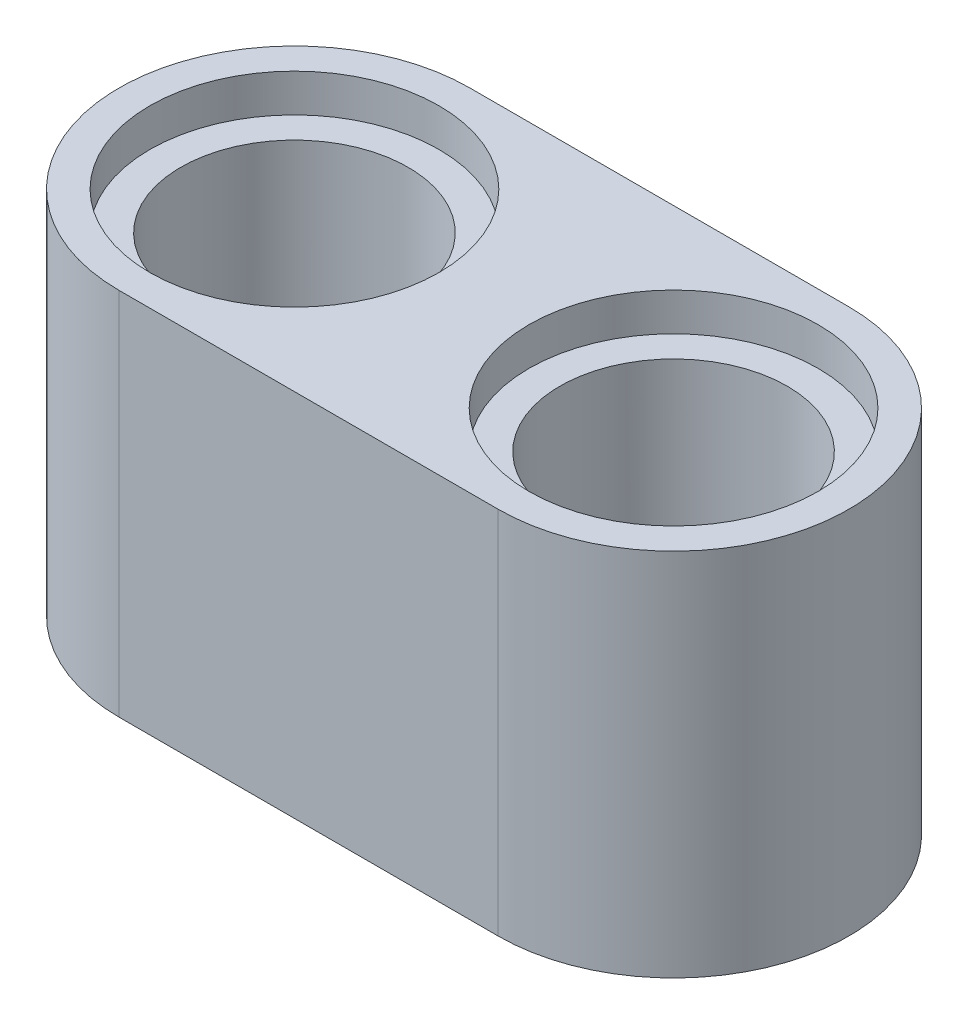
ISO-10303-21;
HEADER;
FILE_DESCRIPTION(('STEP AP214'),'2;1');
FILE_NAME('part.step','',(''),(''),'','','');
FILE_SCHEMA(('AUTOMOTIVE_DESIGN { 1 0 10303 214 1 1 1 1 }'));
ENDSEC;
DATA;
#1=APPLICATION_CONTEXT('core data for automotive mechanical design processes');
#2=APPLICATION_PROTOCOL_DEFINITION('international standard','automotive_design',2000,#1);
#3=PRODUCT_CONTEXT('',#1,'mechanical');
#4=PRODUCT('Part','Part','',(#3));
#5=PRODUCT_RELATED_PRODUCT_CATEGORY('part','',(#4));
#6=PRODUCT_DEFINITION_FORMATION('','',#4);
#7=PRODUCT_DEFINITION_CONTEXT('part definition',#1,'design');
#8=PRODUCT_DEFINITION('design','',#6,#7);
#9=PRODUCT_DEFINITION_SHAPE('','',#8);
#10=(LENGTH_UNIT() NAMED_UNIT(*) SI_UNIT(.MILLI.,.METRE.));
#11=(NAMED_UNIT(*) PLANE_ANGLE_UNIT() SI_UNIT($,.RADIAN.));
#12=(NAMED_UNIT(*) SI_UNIT($,.STERADIAN.) SOLID_ANGLE_UNIT());
#13=UNCERTAINTY_MEASURE_WITH_UNIT(LENGTH_MEASURE(1.E-05),#10,'distance_accuracy_value','');
#14=(GEOMETRIC_REPRESENTATION_CONTEXT(3) GLOBAL_UNCERTAINTY_ASSIGNED_CONTEXT((#13)) GLOBAL_UNIT_ASSIGNED_CONTEXT((#10,
#11,#12)) REPRESENTATION_CONTEXT('',''));
#15=CARTESIAN_POINT('',(0.,0.,0.));
#16=DIRECTION('',(0.,0.,1.));
#17=DIRECTION('',(1.,0.,0.));
#18=AXIS2_PLACEMENT_3D('',#15,#16,#17);
#19=CARTESIAN_POINT('',(-16.,0.,0.));
#20=DIRECTION('',(0.,1.,0.));
#21=DIRECTION('',(0.,0.,1.));
#22=AXIS2_PLACEMENT_3D('',#19,#20,#21);
#23=CYLINDRICAL_SURFACE('',#22,2.4);
#24=CARTESIAN_POINT('',(-16.,7.,0.));
#25=DIRECTION('',(0.,1.,0.));
#26=DIRECTION('',(0.,0.,1.));
#27=AXIS2_PLACEMENT_3D('',#24,#25,#26);
#28=CIRCLE('',#27,2.4);
#29=CARTESIAN_POINT('',(-16.,7.,2.4));
#30=VERTEX_POINT('',#29);
#31=EDGE_CURVE('E115',#30,#30,#28,.F.);
#32=ORIENTED_EDGE('',*,*,#31,.F.);
#33=EDGE_LOOP('',(#32));
#34=FACE_BOUND('',#33,.T.);
#35=CARTESIAN_POINT('',(-16.,0.8,0.));
#36=DIRECTION('',(0.,-1.,0.));
#37=DIRECTION('',(0.,0.,-1.));
#38=AXIS2_PLACEMENT_3D('',#35,#36,#37);
#39=CIRCLE('',#38,2.4);
#40=CARTESIAN_POINT('',(-16.,0.8,-2.4));
#41=VERTEX_POINT('',#40);
#42=EDGE_CURVE('E40',#41,#41,#39,.F.);
#43=ORIENTED_EDGE('',*,*,#42,.F.);
#44=EDGE_LOOP('',(#43));
#45=FACE_BOUND('',#44,.T.);
#46=ADVANCED_FACE('F36',(#34,#45),#23,.F.);
#47=CARTESIAN_POINT('',(-8.,7.8,0.));
#48=DIRECTION('',(0.,-1.,0.));
#49=DIRECTION('',(0.,0.,-1.));
#50=AXIS2_PLACEMENT_3D('',#47,#48,#49);
#51=PLANE('',#50);
#52=CARTESIAN_POINT('',(-16.,7.8,0.));
#53=DIRECTION('',(0.,1.,0.));
#54=DIRECTION('',(0.,0.,1.));
#55=AXIS2_PLACEMENT_3D('',#52,#53,#54);
#56=CIRCLE('',#55,3.05);
#57=CARTESIAN_POINT('',(-16.,7.8,3.05));
#58=VERTEX_POINT('',#57);
#59=EDGE_CURVE('E143',#58,#58,#56,.T.);
#60=ORIENTED_EDGE('',*,*,#59,.F.);
#61=EDGE_LOOP('',(#60));
#62=FACE_BOUND('',#61,.T.);
#63=CARTESIAN_POINT('',(-8.,7.8,0.));
#64=DIRECTION('',(0.,1.,0.));
#65=DIRECTION('',(0.,0.,-1.));
#66=AXIS2_PLACEMENT_3D('',#63,#64,#65);
#67=CIRCLE('',#66,3.05);
#68=CARTESIAN_POINT('',(-8.,7.8,-3.05));
#69=VERTEX_POINT('',#68);
#70=EDGE_CURVE('E126',#69,#69,#67,.T.);
#71=ORIENTED_EDGE('',*,*,#70,.F.);
#72=EDGE_LOOP('',(#71));
#73=FACE_BOUND('',#72,.T.);
#74=CARTESIAN_POINT('',(-8.,7.8,0.));
#75=DIRECTION('',(0.,-1.,0.));
#76=DIRECTION('',(0.,0.,-1.));
#77=AXIS2_PLACEMENT_3D('',#74,#75,#76);
#78=CIRCLE('',#77,3.7);
#79=CARTESIAN_POINT('',(-8.,7.8,-3.7));
#80=VERTEX_POINT('',#79);
#81=CARTESIAN_POINT('',(-8.,7.8,3.7));
#82=VERTEX_POINT('',#81);
#83=EDGE_CURVE('E97',#80,#82,#78,.T.);
#84=ORIENTED_EDGE('',*,*,#83,.F.);
#85=DIRECTION('',(1.,0.,0.));
#86=VECTOR('',#85,1.);
#87=CARTESIAN_POINT('',(-16.,7.8,-3.7));
#88=LINE('',#87,#86);
#89=CARTESIAN_POINT('',(-16.,7.8,-3.7));
#90=VERTEX_POINT('',#89);
#91=EDGE_CURVE('E89',#90,#80,#88,.T.);
#92=ORIENTED_EDGE('',*,*,#91,.F.);
#93=CARTESIAN_POINT('',(-16.,7.8,0.));
#94=DIRECTION('',(0.,1.,0.));
#95=DIRECTION('',(0.,0.,1.));
#96=AXIS2_PLACEMENT_3D('',#93,#94,#95);
#97=CIRCLE('',#96,3.7);
#98=CARTESIAN_POINT('',(-16.,7.8,3.7));
#99=VERTEX_POINT('',#98);
#100=EDGE_CURVE('E85',#90,#99,#97,.T.);
#101=ORIENTED_EDGE('',*,*,#100,.T.);
#102=DIRECTION('',(-1.,0.,0.));
#103=VECTOR('',#102,1.);
#104=CARTESIAN_POINT('',(-8.,7.8,3.7));
#105=LINE('',#104,#103);
#106=EDGE_CURVE('E88',#82,#99,#105,.T.);
#107=ORIENTED_EDGE('',*,*,#106,.F.);
#108=EDGE_LOOP('',(#84,#92,#101,#107));
#109=FACE_BOUND('',#108,.T.);
#110=ADVANCED_FACE('F87',(#62,#73,#109),#51,.F.);
#111=CARTESIAN_POINT('',(-8.,0.,0.));
#112=DIRECTION('',(0.,-1.,0.));
#113=DIRECTION('',(0.,0.,-1.));
#114=AXIS2_PLACEMENT_3D('',#111,#112,#113);
#115=PLANE('',#114);
#116=CARTESIAN_POINT('',(-16.,0.,0.));
#117=DIRECTION('',(0.,-1.,0.));
#118=DIRECTION('',(0.,0.,-1.));
#119=AXIS2_PLACEMENT_3D('',#116,#117,#118);
#120=CIRCLE('',#119,3.05);
#121=CARTESIAN_POINT('',(-16.,0.,-3.05));
#122=VERTEX_POINT('',#121);
#123=EDGE_CURVE('E128',#122,#122,#120,.T.);
#124=ORIENTED_EDGE('',*,*,#123,.F.);
#125=EDGE_LOOP('',(#124));
#126=FACE_BOUND('',#125,.T.);
#127=CARTESIAN_POINT('',(-8.,0.,0.));
#128=DIRECTION('',(0.,-1.,0.));
#129=DIRECTION('',(0.,0.,1.));
#130=AXIS2_PLACEMENT_3D('',#127,#128,#129);
#131=CIRCLE('',#130,3.05);
#132=CARTESIAN_POINT('',(-8.,0.,3.05));
#133=VERTEX_POINT('',#132);
#134=EDGE_CURVE('E138',#133,#133,#131,.T.);
#135=ORIENTED_EDGE('',*,*,#134,.F.);
#136=EDGE_LOOP('',(#135));
#137=FACE_BOUND('',#136,.T.);
#138=CARTESIAN_POINT('',(-8.,0.,0.));
#139=DIRECTION('',(0.,-1.,0.));
#140=DIRECTION('',(0.,0.,-1.));
#141=AXIS2_PLACEMENT_3D('',#138,#139,#140);
#142=CIRCLE('',#141,3.7);
#143=CARTESIAN_POINT('',(-8.,0.,-3.7));
#144=VERTEX_POINT('',#143);
#145=CARTESIAN_POINT('',(-8.,0.,3.7));
#146=VERTEX_POINT('',#145);
#147=EDGE_CURVE('E104',#144,#146,#142,.T.);
#148=ORIENTED_EDGE('',*,*,#147,.T.);
#149=DIRECTION('',(-1.,0.,0.));
#150=VECTOR('',#149,1.);
#151=CARTESIAN_POINT('',(-8.,0.,3.7));
#152=LINE('',#151,#150);
#153=CARTESIAN_POINT('',(-16.,0.,3.7));
#154=VERTEX_POINT('',#153);
#155=EDGE_CURVE('E107',#146,#154,#152,.T.);
#156=ORIENTED_EDGE('',*,*,#155,.T.);
#157=CARTESIAN_POINT('',(-16.,0.,0.));
#158=DIRECTION('',(0.,1.,0.));
#159=DIRECTION('',(0.,0.,1.));
#160=AXIS2_PLACEMENT_3D('',#157,#158,#159);
#161=CIRCLE('',#160,3.7);
#162=CARTESIAN_POINT('',(-16.,0.,-3.7));
#163=VERTEX_POINT('',#162);
#164=EDGE_CURVE('E93',#163,#154,#161,.T.);
#165=ORIENTED_EDGE('',*,*,#164,.F.);
#166=DIRECTION('',(1.,0.,0.));
#167=VECTOR('',#166,1.);
#168=CARTESIAN_POINT('',(-16.,0.,-3.7));
#169=LINE('',#168,#167);
#170=EDGE_CURVE('E99',#163,#144,#169,.T.);
#171=ORIENTED_EDGE('',*,*,#170,.T.);
#172=EDGE_LOOP('',(#148,#156,#165,#171));
#173=FACE_BOUND('',#172,.T.);
#174=ADVANCED_FACE('F154',(#126,#137,#173),#115,.T.);
#175=CARTESIAN_POINT('',(-8.,7.8,0.));
#176=DIRECTION('',(0.,-1.,0.));
#177=DIRECTION('',(0.,0.,-1.));
#178=AXIS2_PLACEMENT_3D('',#175,#176,#177);
#179=CYLINDRICAL_SURFACE('',#178,3.7);
#180=ORIENTED_EDGE('',*,*,#147,.F.);
#181=DIRECTION('',(0.,-1.,0.));
#182=VECTOR('',#181,1.);
#183=CARTESIAN_POINT('',(-8.,7.8,-3.7));
#184=LINE('',#183,#182);
#185=EDGE_CURVE('E11',#80,#144,#184,.T.);
#186=ORIENTED_EDGE('',*,*,#185,.F.);
#187=ORIENTED_EDGE('',*,*,#83,.T.);
#188=DIRECTION('',(0.,-1.,0.));
#189=VECTOR('',#188,1.);
#190=CARTESIAN_POINT('',(-8.,7.8,3.7));
#191=LINE('',#190,#189);
#192=EDGE_CURVE('E80',#82,#146,#191,.T.);
#193=ORIENTED_EDGE('',*,*,#192,.T.);
#194=EDGE_LOOP('',(#180,#186,#187,#193));
#195=FACE_BOUND('',#194,.T.);
#196=ADVANCED_FACE('F38',(#195),#179,.T.);
#197=CARTESIAN_POINT('',(-16.,7.8,-3.7));
#198=DIRECTION('',(0.,0.,-1.));
#199=DIRECTION('',(-1.,0.,0.));
#200=AXIS2_PLACEMENT_3D('',#197,#198,#199);
#201=PLANE('',#200);
#202=ORIENTED_EDGE('',*,*,#170,.F.);
#203=DIRECTION('',(0.,-1.,0.));
#204=VECTOR('',#203,1.);
#205=CARTESIAN_POINT('',(-16.,7.8,-3.7));
#206=LINE('',#205,#204);
#207=EDGE_CURVE('E46',#90,#163,#206,.T.);
#208=ORIENTED_EDGE('',*,*,#207,.F.);
#209=ORIENTED_EDGE('',*,*,#91,.T.);
#210=ORIENTED_EDGE('',*,*,#185,.T.);
#211=EDGE_LOOP('',(#202,#208,#209,#210));
#212=FACE_BOUND('',#211,.T.);
#213=ADVANCED_FACE('F169',(#212),#201,.T.);
#214=CARTESIAN_POINT('',(-16.,7.8,0.));
#215=DIRECTION('',(0.,-1.,0.));
#216=DIRECTION('',(0.,0.,-1.));
#217=AXIS2_PLACEMENT_3D('',#214,#215,#216);
#218=CYLINDRICAL_SURFACE('',#217,3.7);
#219=ORIENTED_EDGE('',*,*,#164,.T.);
#220=DIRECTION('',(0.,-1.,0.));
#221=VECTOR('',#220,1.);
#222=CARTESIAN_POINT('',(-16.,7.8,3.7));
#223=LINE('',#222,#221);
#224=EDGE_CURVE('E91',#99,#154,#223,.T.);
#225=ORIENTED_EDGE('',*,*,#224,.F.);
#226=ORIENTED_EDGE('',*,*,#100,.F.);
#227=ORIENTED_EDGE('',*,*,#207,.T.);
#228=EDGE_LOOP('',(#219,#225,#226,#227));
#229=FACE_BOUND('',#228,.T.);
#230=ADVANCED_FACE('F92',(#229),#218,.T.);
#231=CARTESIAN_POINT('',(-8.,7.8,3.7));
#232=DIRECTION('',(0.,0.,1.));
#233=DIRECTION('',(1.,0.,0.));
#234=AXIS2_PLACEMENT_3D('',#231,#232,#233);
#235=PLANE('',#234);
#236=ORIENTED_EDGE('',*,*,#155,.F.);
#237=ORIENTED_EDGE('',*,*,#192,.F.);
#238=ORIENTED_EDGE('',*,*,#106,.T.);
#239=ORIENTED_EDGE('',*,*,#224,.T.);
#240=EDGE_LOOP('',(#236,#237,#238,#239));
#241=FACE_BOUND('',#240,.T.);
#242=ADVANCED_FACE('F96',(#241),#235,.T.);
#243=CARTESIAN_POINT('',(-8.,0.,0.));
#244=DIRECTION('',(0.,1.,0.));
#245=DIRECTION('',(0.,0.,1.));
#246=AXIS2_PLACEMENT_3D('',#243,#244,#245);
#247=CYLINDRICAL_SURFACE('',#246,2.4);
#248=CARTESIAN_POINT('',(-8.,0.8,0.));
#249=DIRECTION('',(0.,1.,0.));
#250=DIRECTION('',(0.,0.,1.));
#251=AXIS2_PLACEMENT_3D('',#248,#249,#250);
#252=CIRCLE('',#251,2.4);
#253=CARTESIAN_POINT('',(-8.,0.8,2.4));
#254=VERTEX_POINT('',#253);
#255=EDGE_CURVE('E120',#254,#254,#252,.T.);
#256=ORIENTED_EDGE('',*,*,#255,.F.);
#257=EDGE_LOOP('',(#256));
#258=FACE_BOUND('',#257,.T.);
#259=CARTESIAN_POINT('',(-8.,7.,0.));
#260=DIRECTION('',(0.,-1.,0.));
#261=DIRECTION('',(0.,0.,-1.));
#262=AXIS2_PLACEMENT_3D('',#259,#260,#261);
#263=CIRCLE('',#262,2.4);
#264=CARTESIAN_POINT('',(-8.,7.,-2.4));
#265=VERTEX_POINT('',#264);
#266=EDGE_CURVE('E108',#265,#265,#263,.T.);
#267=ORIENTED_EDGE('',*,*,#266,.F.);
#268=EDGE_LOOP('',(#267));
#269=FACE_BOUND('',#268,.T.);
#270=ADVANCED_FACE('F167',(#258,#269),#247,.F.);
#271=CARTESIAN_POINT('',(-16.,7.,0.));
#272=DIRECTION('',(0.,1.,0.));
#273=DIRECTION('',(0.,0.,1.));
#274=AXIS2_PLACEMENT_3D('',#271,#272,#273);
#275=PLANE('',#274);
#276=CARTESIAN_POINT('',(-16.,7.,0.));
#277=DIRECTION('',(0.,1.,0.));
#278=DIRECTION('',(0.,0.,1.));
#279=AXIS2_PLACEMENT_3D('',#276,#277,#278);
#280=CIRCLE('',#279,3.05);
#281=CARTESIAN_POINT('',(-16.,7.,3.05));
#282=VERTEX_POINT('',#281);
#283=EDGE_CURVE('E118',#282,#282,#280,.T.);
#284=ORIENTED_EDGE('',*,*,#283,.T.);
#285=EDGE_LOOP('',(#284));
#286=FACE_BOUND('',#285,.T.);
#287=ORIENTED_EDGE('',*,*,#31,.T.);
#288=EDGE_LOOP('',(#287));
#289=FACE_BOUND('',#288,.T.);
#290=ADVANCED_FACE('F177',(#286,#289),#275,.T.);
#291=CARTESIAN_POINT('',(-16.,7.,0.));
#292=DIRECTION('',(0.,1.,0.));
#293=DIRECTION('',(0.,0.,1.));
#294=AXIS2_PLACEMENT_3D('',#291,#292,#293);
#295=CYLINDRICAL_SURFACE('',#294,3.05);
#296=ORIENTED_EDGE('',*,*,#283,.F.);
#297=EDGE_LOOP('',(#296));
#298=FACE_BOUND('',#297,.T.);
#299=ORIENTED_EDGE('',*,*,#59,.T.);
#300=EDGE_LOOP('',(#299));
#301=FACE_BOUND('',#300,.T.);
#302=ADVANCED_FACE('F182',(#298,#301),#295,.F.);
#303=CARTESIAN_POINT('',(-8.,7.,0.));
#304=DIRECTION('',(0.,1.,0.));
#305=DIRECTION('',(0.,0.,1.));
#306=AXIS2_PLACEMENT_3D('',#303,#304,#305);
#307=CYLINDRICAL_SURFACE('',#306,3.05);
#308=CARTESIAN_POINT('',(-8.,7.,0.));
#309=DIRECTION('',(0.,1.,0.));
#310=DIRECTION('',(0.,0.,-1.));
#311=AXIS2_PLACEMENT_3D('',#308,#309,#310);
#312=CIRCLE('',#311,3.05);
#313=CARTESIAN_POINT('',(-8.,7.,-3.05));
#314=VERTEX_POINT('',#313);
#315=EDGE_CURVE('E146',#314,#314,#312,.T.);
#316=ORIENTED_EDGE('',*,*,#315,.F.);
#317=EDGE_LOOP('',(#316));
#318=FACE_BOUND('',#317,.T.);
#319=ORIENTED_EDGE('',*,*,#70,.T.);
#320=EDGE_LOOP('',(#319));
#321=FACE_BOUND('',#320,.T.);
#322=ADVANCED_FACE('F151',(#318,#321),#307,.F.);
#323=CARTESIAN_POINT('',(-8.,7.,0.));
#324=DIRECTION('',(0.,-1.,0.));
#325=DIRECTION('',(0.,0.,-1.));
#326=AXIS2_PLACEMENT_3D('',#323,#324,#325);
#327=PLANE('',#326);
#328=ORIENTED_EDGE('',*,*,#266,.T.);
#329=EDGE_LOOP('',(#328));
#330=FACE_BOUND('',#329,.T.);
#331=ORIENTED_EDGE('',*,*,#315,.T.);
#332=EDGE_LOOP('',(#331));
#333=FACE_BOUND('',#332,.T.);
#334=ADVANCED_FACE('F188',(#330,#333),#327,.F.);
#335=CARTESIAN_POINT('',(-8.,0.8,0.));
#336=DIRECTION('',(0.,-1.,0.));
#337=DIRECTION('',(0.,0.,-1.));
#338=AXIS2_PLACEMENT_3D('',#335,#336,#337);
#339=CYLINDRICAL_SURFACE('',#338,3.05);
#340=CARTESIAN_POINT('',(-8.,0.8,0.));
#341=DIRECTION('',(0.,-1.,0.));
#342=DIRECTION('',(0.,0.,1.));
#343=AXIS2_PLACEMENT_3D('',#340,#341,#342);
#344=CIRCLE('',#343,3.05);
#345=CARTESIAN_POINT('',(-8.,0.8,3.05));
#346=VERTEX_POINT('',#345);
#347=EDGE_CURVE('E133',#346,#346,#344,.T.);
#348=ORIENTED_EDGE('',*,*,#347,.F.);
#349=EDGE_LOOP('',(#348));
#350=FACE_BOUND('',#349,.T.);
#351=ORIENTED_EDGE('',*,*,#134,.T.);
#352=EDGE_LOOP('',(#351));
#353=FACE_BOUND('',#352,.T.);
#354=ADVANCED_FACE('F191',(#350,#353),#339,.F.);
#355=CARTESIAN_POINT('',(-8.,0.8,0.));
#356=DIRECTION('',(0.,1.,0.));
#357=DIRECTION('',(0.,0.,1.));
#358=AXIS2_PLACEMENT_3D('',#355,#356,#357);
#359=PLANE('',#358);
#360=ORIENTED_EDGE('',*,*,#255,.T.);
#361=EDGE_LOOP('',(#360));
#362=FACE_BOUND('',#361,.T.);
#363=ORIENTED_EDGE('',*,*,#347,.T.);
#364=EDGE_LOOP('',(#363));
#365=FACE_BOUND('',#364,.T.);
#366=ADVANCED_FACE('F205',(#362,#365),#359,.F.);
#367=CARTESIAN_POINT('',(-16.,0.8,0.));
#368=DIRECTION('',(0.,-1.,0.));
#369=DIRECTION('',(0.,0.,-1.));
#370=AXIS2_PLACEMENT_3D('',#367,#368,#369);
#371=PLANE('',#370);
#372=CARTESIAN_POINT('',(-16.,0.8,0.));
#373=DIRECTION('',(0.,-1.,0.));
#374=DIRECTION('',(0.,0.,-1.));
#375=AXIS2_PLACEMENT_3D('',#372,#373,#374);
#376=CIRCLE('',#375,3.05);
#377=CARTESIAN_POINT('',(-16.,0.8,-3.05));
#378=VERTEX_POINT('',#377);
#379=EDGE_CURVE('E122',#378,#378,#376,.T.);
#380=ORIENTED_EDGE('',*,*,#379,.T.);
#381=EDGE_LOOP('',(#380));
#382=FACE_BOUND('',#381,.T.);
#383=ORIENTED_EDGE('',*,*,#42,.T.);
#384=EDGE_LOOP('',(#383));
#385=FACE_BOUND('',#384,.T.);
#386=ADVANCED_FACE('F209',(#382,#385),#371,.T.);
#387=CARTESIAN_POINT('',(-16.,0.8,0.));
#388=DIRECTION('',(0.,-1.,0.));
#389=DIRECTION('',(0.,0.,-1.));
#390=AXIS2_PLACEMENT_3D('',#387,#388,#389);
#391=CYLINDRICAL_SURFACE('',#390,3.05);
#392=ORIENTED_EDGE('',*,*,#379,.F.);
#393=EDGE_LOOP('',(#392));
#394=FACE_BOUND('',#393,.T.);
#395=ORIENTED_EDGE('',*,*,#123,.T.);
#396=EDGE_LOOP('',(#395));
#397=FACE_BOUND('',#396,.T.);
#398=ADVANCED_FACE('F210',(#394,#397),#391,.F.);
#399=CLOSED_SHELL('',(#46,#110,#174,#196,#213,#230,#242,#270,#290,#302,#322,#334,#354,#366,#386,#398));
#400=MANIFOLD_SOLID_BREP('B2',#399);
#401=ADVANCED_BREP_SHAPE_REPRESENTATION('',(#18,#400),#14);
#402=SHAPE_DEFINITION_REPRESENTATION(#9,#401);
ENDSEC;
END-ISO-10303-21;
